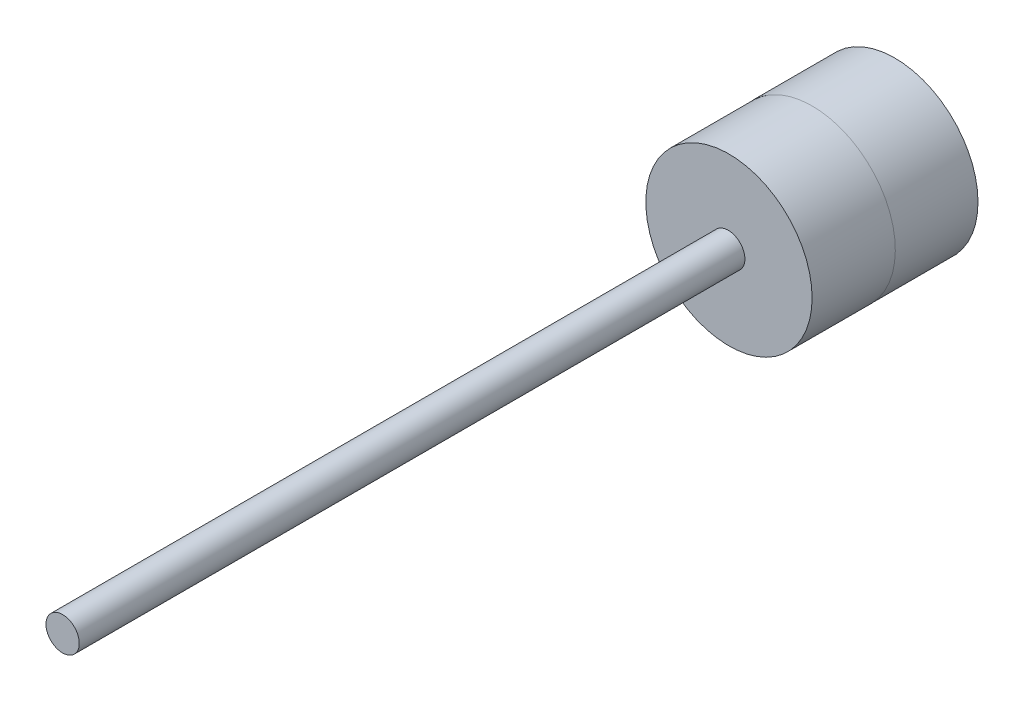
ISO-10303-21;
HEADER;
FILE_DESCRIPTION(('STEP AP214'),'2;1');
FILE_NAME('part.step','',(''),(''),'','','');
FILE_SCHEMA(('AUTOMOTIVE_DESIGN { 1 0 10303 214 1 1 1 1 }'));
ENDSEC;
DATA;
#1=APPLICATION_CONTEXT('core data for automotive mechanical design processes');
#2=APPLICATION_PROTOCOL_DEFINITION('international standard','automotive_design',2000,#1);
#3=PRODUCT_CONTEXT('',#1,'mechanical');
#4=PRODUCT('Part','Part','',(#3));
#5=PRODUCT_RELATED_PRODUCT_CATEGORY('part','',(#4));
#6=PRODUCT_DEFINITION_FORMATION('','',#4);
#7=PRODUCT_DEFINITION_CONTEXT('part definition',#1,'design');
#8=PRODUCT_DEFINITION('design','',#6,#7);
#9=PRODUCT_DEFINITION_SHAPE('','',#8);
#10=(LENGTH_UNIT() NAMED_UNIT(*) SI_UNIT(.MILLI.,.METRE.));
#11=(NAMED_UNIT(*) PLANE_ANGLE_UNIT() SI_UNIT($,.RADIAN.));
#12=(NAMED_UNIT(*) SI_UNIT($,.STERADIAN.) SOLID_ANGLE_UNIT());
#13=UNCERTAINTY_MEASURE_WITH_UNIT(LENGTH_MEASURE(1.E-05),#10,'distance_accuracy_value','');
#14=(GEOMETRIC_REPRESENTATION_CONTEXT(3) GLOBAL_UNCERTAINTY_ASSIGNED_CONTEXT((#13)) GLOBAL_UNIT_ASSIGNED_CONTEXT((#10,
#11,#12)) REPRESENTATION_CONTEXT('',''));
#15=CARTESIAN_POINT('',(0.,0.,0.));
#16=DIRECTION('',(0.,0.,1.));
#17=DIRECTION('',(1.,0.,0.));
#18=AXIS2_PLACEMENT_3D('',#15,#16,#17);
#19=CARTESIAN_POINT('',(-48.4521089988716,26.2927321344587,5.));
#20=DIRECTION('',(0.,0.,1.));
#21=DIRECTION('',(1.,0.,0.));
#22=AXIS2_PLACEMENT_3D('',#19,#20,#21);
#23=PLANE('',#22);
#24=CARTESIAN_POINT('',(-48.4164480446573,26.3174785422366,5.));
#25=DIRECTION('',(0.,0.,1.));
#26=DIRECTION('',(1.,0.,0.));
#27=AXIS2_PLACEMENT_3D('',#24,#25,#26);
#28=CIRCLE('',#27,4.99626081318599);
#29=CARTESIAN_POINT('',(-50.9194284948321,30.6415635297709,5.));
#30=VERTEX_POINT('',#29);
#31=CARTESIAN_POINT('',(-45.2416611408833,22.4595840090743,5.));
#32=VERTEX_POINT('',#31);
#33=EDGE_CURVE('E56',#30,#32,#28,.T.);
#34=ORIENTED_EDGE('',*,*,#33,.F.);
#35=CARTESIAN_POINT('',(-48.4521089988716,26.2927321344587,5.));
#36=DIRECTION('',(0.,0.,1.));
#37=DIRECTION('',(1.,0.,0.));
#38=AXIS2_PLACEMENT_3D('',#35,#36,#37);
#39=CIRCLE('',#38,5.);
#40=EDGE_CURVE('E49',#30,#32,#39,.T.);
#41=ORIENTED_EDGE('',*,*,#40,.T.);
#42=EDGE_LOOP('',(#34,#41));
#43=FACE_BOUND('',#42,.T.);
#44=ADVANCED_FACE('F39',(#43),#23,.T.);
#45=CARTESIAN_POINT('',(-48.4521089988716,26.2927321344587,0.));
#46=DIRECTION('',(0.,0.,1.));
#47=DIRECTION('',(1.,0.,0.));
#48=AXIS2_PLACEMENT_3D('',#45,#46,#47);
#49=PLANE('',#48);
#50=CARTESIAN_POINT('',(-48.4521089988716,26.2927321344587,0.));
#51=DIRECTION('',(0.,0.,1.));
#52=DIRECTION('',(1.,0.,0.));
#53=AXIS2_PLACEMENT_3D('',#50,#51,#52);
#54=CIRCLE('',#53,5.);
#55=CARTESIAN_POINT('',(-43.4521089988716,26.2927321344587,0.));
#56=VERTEX_POINT('',#55);
#57=EDGE_CURVE('E43',#56,#56,#54,.T.);
#58=ORIENTED_EDGE('',*,*,#57,.F.);
#59=EDGE_LOOP('',(#58));
#60=FACE_BOUND('',#59,.T.);
#61=DIRECTION('',(0.,1.,0.));
#62=VECTOR('',#61,1.);
#63=CARTESIAN_POINT('',(-46.4549079609032,26.2927321344587,0.));
#64=LINE('',#63,#62);
#65=CARTESIAN_POINT('',(-46.4549079609032,24.7890074209763,0.));
#66=VERTEX_POINT('',#65);
#67=CARTESIAN_POINT('',(-46.4549079609032,27.7964568479412,0.));
#68=VERTEX_POINT('',#67);
#69=EDGE_CURVE('E95',#66,#68,#64,.T.);
#70=ORIENTED_EDGE('',*,*,#69,.T.);
#71=CARTESIAN_POINT('',(-48.4521089988716,26.2927321344587,0.));
#72=DIRECTION('',(0.,0.,1.));
#73=DIRECTION('',(1.,0.,0.));
#74=AXIS2_PLACEMENT_3D('',#71,#72,#73);
#75=CIRCLE('',#74,2.5);
#76=EDGE_CURVE('E102',#68,#66,#75,.T.);
#77=ORIENTED_EDGE('',*,*,#76,.T.);
#78=EDGE_LOOP('',(#70,#77));
#79=FACE_BOUND('',#78,.T.);
#80=ADVANCED_FACE('F123',(#60,#79),#49,.F.);
#81=CARTESIAN_POINT('',(-48.4521089988716,26.2927321344587,5.));
#82=DIRECTION('',(0.,0.,-1.));
#83=DIRECTION('',(-1.,0.,0.));
#84=AXIS2_PLACEMENT_3D('',#81,#82,#83);
#85=CYLINDRICAL_SURFACE('',#84,5.);
#86=ORIENTED_EDGE('',*,*,#40,.F.);
#87=EDGE_CURVE('E78',#32,#30,#39,.T.);
#88=ORIENTED_EDGE('',*,*,#87,.F.);
#89=EDGE_LOOP('',(#86,#88));
#90=FACE_BOUND('',#89,.T.);
#91=ORIENTED_EDGE('',*,*,#57,.T.);
#92=EDGE_LOOP('',(#91));
#93=FACE_BOUND('',#92,.T.);
#94=ADVANCED_FACE('F41',(#90,#93),#85,.T.);
#95=CARTESIAN_POINT('',(-46.4549079609032,26.2927321344587,5.));
#96=DIRECTION('',(-1.,0.,0.));
#97=DIRECTION('',(0.,0.,1.));
#98=AXIS2_PLACEMENT_3D('',#95,#96,#97);
#99=PLANE('',#98);
#100=ORIENTED_EDGE('',*,*,#69,.F.);
#101=DIRECTION('',(0.,0.,-1.));
#102=VECTOR('',#101,1.);
#103=CARTESIAN_POINT('',(-46.4549079609032,24.7890074209763,5.));
#104=LINE('',#103,#102);
#105=CARTESIAN_POINT('',(-46.4549079609032,24.7890074209763,5.));
#106=VERTEX_POINT('',#105);
#107=EDGE_CURVE('E105',#106,#66,#104,.T.);
#108=ORIENTED_EDGE('',*,*,#107,.F.);
#109=DIRECTION('',(0.,1.,0.));
#110=VECTOR('',#109,1.);
#111=CARTESIAN_POINT('',(-46.4549079609032,26.2927321344587,5.));
#112=LINE('',#111,#110);
#113=CARTESIAN_POINT('',(-46.4549079609032,27.7964568479412,5.));
#114=VERTEX_POINT('',#113);
#115=EDGE_CURVE('E98',#106,#114,#112,.T.);
#116=ORIENTED_EDGE('',*,*,#115,.T.);
#117=DIRECTION('',(0.,0.,-1.));
#118=VECTOR('',#117,1.);
#119=CARTESIAN_POINT('',(-46.4549079609032,27.7964568479412,5.));
#120=LINE('',#119,#118);
#121=EDGE_CURVE('E114',#114,#68,#120,.T.);
#122=ORIENTED_EDGE('',*,*,#121,.T.);
#123=EDGE_LOOP('',(#100,#108,#116,#122));
#124=FACE_BOUND('',#123,.T.);
#125=ADVANCED_FACE('F127',(#124),#99,.T.);
#126=CARTESIAN_POINT('',(-48.4521089988716,26.2927321344587,5.));
#127=DIRECTION('',(0.,0.,-1.));
#128=DIRECTION('',(-1.,0.,0.));
#129=AXIS2_PLACEMENT_3D('',#126,#127,#128);
#130=CYLINDRICAL_SURFACE('',#129,2.5);
#131=ORIENTED_EDGE('',*,*,#76,.F.);
#132=ORIENTED_EDGE('',*,*,#121,.F.);
#133=CARTESIAN_POINT('',(-48.4521089988716,26.2927321344587,5.));
#134=DIRECTION('',(0.,0.,1.));
#135=DIRECTION('',(1.,0.,0.));
#136=AXIS2_PLACEMENT_3D('',#133,#134,#135);
#137=CIRCLE('',#136,2.5);
#138=EDGE_CURVE('E63',#114,#106,#137,.T.);
#139=ORIENTED_EDGE('',*,*,#138,.T.);
#140=ORIENTED_EDGE('',*,*,#107,.T.);
#141=EDGE_LOOP('',(#131,#132,#139,#140));
#142=FACE_BOUND('',#141,.T.);
#143=ADVANCED_FACE('F129',(#142),#130,.F.);
#144=CARTESIAN_POINT('',(-48.4164480446573,26.3174785422366,10.));
#145=DIRECTION('',(0.,0.,1.));
#146=DIRECTION('',(1.,0.,0.));
#147=AXIS2_PLACEMENT_3D('',#144,#145,#146);
#148=PLANE('',#147);
#149=CARTESIAN_POINT('',(-48.4602472988754,26.3217846680622,10.));
#150=DIRECTION('',(0.,0.,1.));
#151=DIRECTION('',(1.,0.,0.));
#152=AXIS2_PLACEMENT_3D('',#149,#150,#151);
#153=CIRCLE('',#152,0.999999999999998);
#154=CARTESIAN_POINT('',(-47.4602472988754,26.3217846680622,10.));
#155=VERTEX_POINT('',#154);
#156=EDGE_CURVE('E11',#155,#155,#153,.T.);
#157=ORIENTED_EDGE('',*,*,#156,.F.);
#158=EDGE_LOOP('',(#157));
#159=FACE_BOUND('',#158,.T.);
#160=CARTESIAN_POINT('',(-48.4164480446573,26.3174785422366,10.));
#161=DIRECTION('',(0.,0.,1.));
#162=DIRECTION('',(1.,0.,0.));
#163=AXIS2_PLACEMENT_3D('',#160,#161,#162);
#164=CIRCLE('',#163,4.99626081318599);
#165=CARTESIAN_POINT('',(-43.4201872314713,26.3174785422366,10.));
#166=VERTEX_POINT('',#165);
#167=EDGE_CURVE('E92',#166,#166,#164,.T.);
#168=ORIENTED_EDGE('',*,*,#167,.T.);
#169=EDGE_LOOP('',(#168));
#170=FACE_BOUND('',#169,.T.);
#171=ADVANCED_FACE('F131',(#159,#170),#148,.T.);
#172=CARTESIAN_POINT('',(-48.4164480446573,26.3174785422366,10.));
#173=DIRECTION('',(0.,0.,-1.));
#174=DIRECTION('',(-1.,0.,0.));
#175=AXIS2_PLACEMENT_3D('',#172,#173,#174);
#176=CYLINDRICAL_SURFACE('',#175,4.99626081318599);
#177=ORIENTED_EDGE('',*,*,#167,.F.);
#178=EDGE_LOOP('',(#177));
#179=FACE_BOUND('',#178,.T.);
#180=ORIENTED_EDGE('',*,*,#33,.T.);
#181=EDGE_CURVE('E84',#32,#30,#28,.T.);
#182=ORIENTED_EDGE('',*,*,#181,.T.);
#183=EDGE_LOOP('',(#180,#182));
#184=FACE_BOUND('',#183,.T.);
#185=ADVANCED_FACE('F90',(#179,#184),#176,.T.);
#186=CARTESIAN_POINT('',(-48.4164480446573,26.3174785422366,5.));
#187=DIRECTION('',(0.,0.,1.));
#188=DIRECTION('',(1.,0.,0.));
#189=AXIS2_PLACEMENT_3D('',#186,#187,#188);
#190=PLANE('',#189);
#191=ORIENTED_EDGE('',*,*,#181,.F.);
#192=ORIENTED_EDGE('',*,*,#87,.T.);
#193=EDGE_LOOP('',(#191,#192));
#194=FACE_BOUND('',#193,.T.);
#195=ADVANCED_FACE('F85',(#194),#190,.F.);
#196=ORIENTED_EDGE('',*,*,#138,.F.);
#197=ORIENTED_EDGE('',*,*,#115,.F.);
#198=EDGE_LOOP('',(#196,#197));
#199=FACE_BOUND('',#198,.T.);
#200=ADVANCED_FACE('F181',(#199),#190,.F.);
#201=CARTESIAN_POINT('',(-48.4602472988754,26.3217846680622,50.));
#202=DIRECTION('',(0.,0.,-1.));
#203=DIRECTION('',(-1.,0.,0.));
#204=AXIS2_PLACEMENT_3D('',#201,#202,#203);
#205=CYLINDRICAL_SURFACE('',#204,0.999999999999998);
#206=CARTESIAN_POINT('',(-48.4602472988754,26.3217846680622,50.));
#207=DIRECTION('',(0.,0.,1.));
#208=DIRECTION('',(1.,0.,0.));
#209=AXIS2_PLACEMENT_3D('',#206,#207,#208);
#210=CIRCLE('',#209,0.999999999999998);
#211=CARTESIAN_POINT('',(-47.4602472988754,26.3217846680622,50.));
#212=VERTEX_POINT('',#211);
#213=EDGE_CURVE('E88',#212,#212,#210,.T.);
#214=ORIENTED_EDGE('',*,*,#213,.F.);
#215=EDGE_LOOP('',(#214));
#216=FACE_BOUND('',#215,.T.);
#217=ORIENTED_EDGE('',*,*,#156,.T.);
#218=EDGE_LOOP('',(#217));
#219=FACE_BOUND('',#218,.T.);
#220=ADVANCED_FACE('F190',(#216,#219),#205,.T.);
#221=CARTESIAN_POINT('',(-48.4602472988754,26.3217846680622,50.));
#222=DIRECTION('',(0.,0.,1.));
#223=DIRECTION('',(1.,0.,0.));
#224=AXIS2_PLACEMENT_3D('',#221,#222,#223);
#225=PLANE('',#224);
#226=ORIENTED_EDGE('',*,*,#213,.T.);
#227=EDGE_LOOP('',(#226));
#228=FACE_BOUND('',#227,.T.);
#229=ADVANCED_FACE('F203',(#228),#225,.T.);
#230=CLOSED_SHELL('',(#44,#80,#94,#125,#143,#171,#185,#195,#200,#220,#229));
#231=MANIFOLD_SOLID_BREP('B2',#230);
#232=ADVANCED_BREP_SHAPE_REPRESENTATION('',(#18,#231),#14);
#233=SHAPE_DEFINITION_REPRESENTATION(#9,#232);
ENDSEC;
END-ISO-10303-21;
